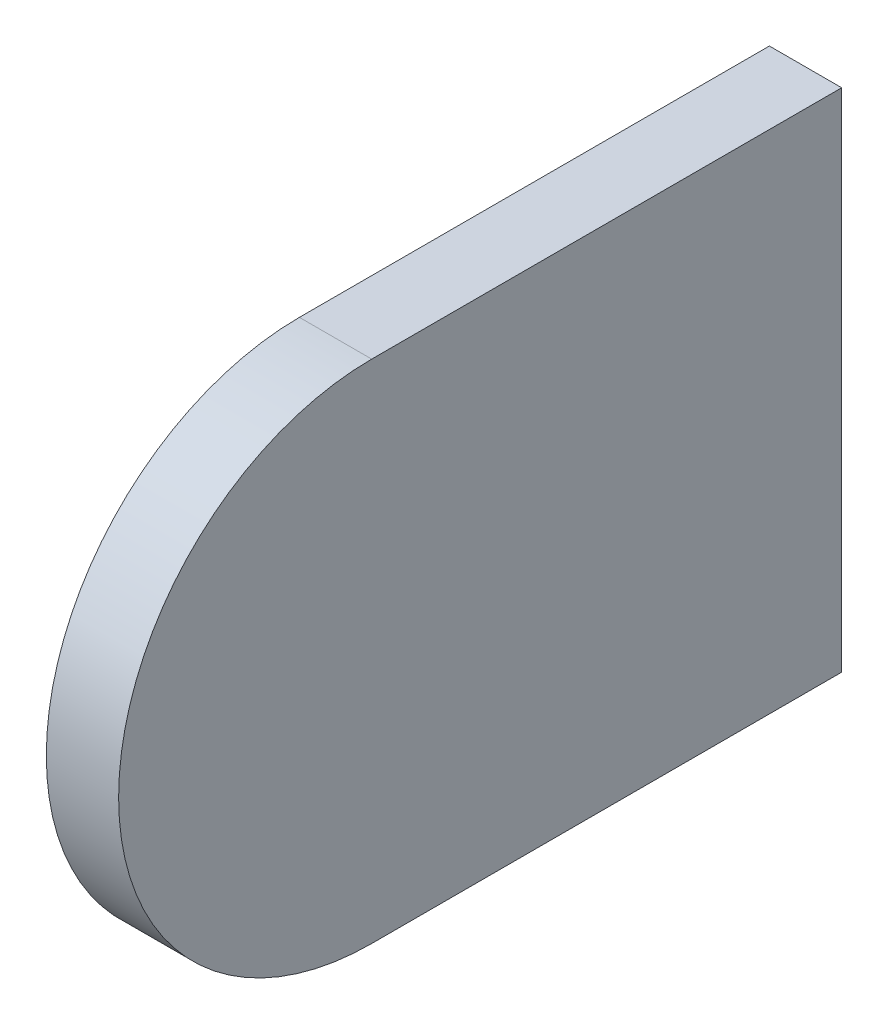
ISO-10303-21;
HEADER;
FILE_DESCRIPTION(('STEP AP214'),'2;1');
FILE_NAME('part.step','',(''),(''),'','','');
FILE_SCHEMA(('AUTOMOTIVE_DESIGN { 1 0 10303 214 1 1 1 1 }'));
ENDSEC;
DATA;
#1=APPLICATION_CONTEXT('core data for automotive mechanical design processes');
#2=APPLICATION_PROTOCOL_DEFINITION('international standard','automotive_design',2000,#1);
#3=PRODUCT_CONTEXT('',#1,'mechanical');
#4=PRODUCT('Part','Part','',(#3));
#5=PRODUCT_RELATED_PRODUCT_CATEGORY('part','',(#4));
#6=PRODUCT_DEFINITION_FORMATION('','',#4);
#7=PRODUCT_DEFINITION_CONTEXT('part definition',#1,'design');
#8=PRODUCT_DEFINITION('design','',#6,#7);
#9=PRODUCT_DEFINITION_SHAPE('','',#8);
#10=(LENGTH_UNIT() NAMED_UNIT(*) SI_UNIT(.MILLI.,.METRE.));
#11=(NAMED_UNIT(*) PLANE_ANGLE_UNIT() SI_UNIT($,.RADIAN.));
#12=(NAMED_UNIT(*) SI_UNIT($,.STERADIAN.) SOLID_ANGLE_UNIT());
#13=UNCERTAINTY_MEASURE_WITH_UNIT(LENGTH_MEASURE(1.E-05),#10,'distance_accuracy_value','');
#14=(GEOMETRIC_REPRESENTATION_CONTEXT(3) GLOBAL_UNCERTAINTY_ASSIGNED_CONTEXT((#13)) GLOBAL_UNIT_ASSIGNED_CONTEXT((#10,
#11,#12)) REPRESENTATION_CONTEXT('',''));
#15=CARTESIAN_POINT('',(0.,0.,0.));
#16=DIRECTION('',(0.,0.,1.));
#17=DIRECTION('',(1.,0.,0.));
#18=AXIS2_PLACEMENT_3D('',#15,#16,#17);
#19=CARTESIAN_POINT('',(0.2,-1.4,0.));
#20=DIRECTION('',(1.,0.,0.));
#21=DIRECTION('',(0.,0.,-1.));
#22=AXIS2_PLACEMENT_3D('',#19,#20,#21);
#23=PLANE('',#22);
#24=DIRECTION('',(0.,1.,0.));
#25=VECTOR('',#24,1.);
#26=CARTESIAN_POINT('',(0.2,0.,0.));
#27=LINE('',#26,#25);
#28=CARTESIAN_POINT('',(0.2,-1.4,0.));
#29=VERTEX_POINT('',#28);
#30=CARTESIAN_POINT('',(0.2,1.4,0.));
#31=VERTEX_POINT('',#30);
#32=EDGE_CURVE('E80',#29,#31,#27,.T.);
#33=ORIENTED_EDGE('',*,*,#32,.T.);
#34=DIRECTION('',(0.,0.,1.));
#35=VECTOR('',#34,1.);
#36=CARTESIAN_POINT('',(0.2,1.4,0.));
#37=LINE('',#36,#35);
#38=CARTESIAN_POINT('',(0.2,1.4,2.6));
#39=VERTEX_POINT('',#38);
#40=EDGE_CURVE('E59',#39,#31,#37,.F.);
#41=ORIENTED_EDGE('',*,*,#40,.F.);
#42=CARTESIAN_POINT('',(0.2,0.,2.6));
#43=DIRECTION('',(1.,0.,0.));
#44=DIRECTION('',(0.,0.,-1.));
#45=AXIS2_PLACEMENT_3D('',#42,#43,#44);
#46=CIRCLE('',#45,1.4);
#47=CARTESIAN_POINT('',(0.2,-1.4,2.6));
#48=VERTEX_POINT('',#47);
#49=EDGE_CURVE('E19',#48,#39,#46,.F.);
#50=ORIENTED_EDGE('',*,*,#49,.F.);
#51=DIRECTION('',(0.,0.,-1.));
#52=VECTOR('',#51,1.);
#53=CARTESIAN_POINT('',(0.2,-1.4,0.));
#54=LINE('',#53,#52);
#55=EDGE_CURVE('E57',#29,#48,#54,.F.);
#56=ORIENTED_EDGE('',*,*,#55,.F.);
#57=EDGE_LOOP('',(#33,#41,#50,#56));
#58=FACE_BOUND('',#57,.T.);
#59=ADVANCED_FACE('F16',(#58),#23,.T.);
#60=CARTESIAN_POINT('',(-0.1,0.,2.6));
#61=DIRECTION('',(1.,0.,0.));
#62=DIRECTION('',(0.,0.,-1.));
#63=AXIS2_PLACEMENT_3D('',#60,#61,#62);
#64=CYLINDRICAL_SURFACE('',#63,1.4);
#65=CARTESIAN_POINT('',(-0.2,0.,2.6));
#66=DIRECTION('',(1.,0.,0.));
#67=DIRECTION('',(0.,0.,-1.));
#68=AXIS2_PLACEMENT_3D('',#65,#66,#67);
#69=CIRCLE('',#68,1.4);
#70=CARTESIAN_POINT('',(-0.2,-1.4,2.6));
#71=VERTEX_POINT('',#70);
#72=CARTESIAN_POINT('',(-0.2,1.4,2.6));
#73=VERTEX_POINT('',#72);
#74=EDGE_CURVE('E67',#71,#73,#69,.F.);
#75=ORIENTED_EDGE('',*,*,#74,.F.);
#76=DIRECTION('',(1.,0.,0.));
#77=VECTOR('',#76,1.);
#78=CARTESIAN_POINT('',(-0.2,-1.4,2.6));
#79=LINE('',#78,#77);
#80=EDGE_CURVE('E64',#48,#71,#79,.F.);
#81=ORIENTED_EDGE('',*,*,#80,.F.);
#82=ORIENTED_EDGE('',*,*,#49,.T.);
#83=DIRECTION('',(1.,0.,0.));
#84=VECTOR('',#83,1.);
#85=CARTESIAN_POINT('',(0.2,1.4,2.6));
#86=LINE('',#85,#84);
#87=EDGE_CURVE('E62',#73,#39,#86,.T.);
#88=ORIENTED_EDGE('',*,*,#87,.F.);
#89=EDGE_LOOP('',(#75,#81,#82,#88));
#90=FACE_BOUND('',#89,.T.);
#91=ADVANCED_FACE('F65',(#90),#64,.T.);
#92=CARTESIAN_POINT('',(0.2,1.4,0.));
#93=DIRECTION('',(0.,1.,0.));
#94=DIRECTION('',(0.,0.,1.));
#95=AXIS2_PLACEMENT_3D('',#92,#93,#94);
#96=PLANE('',#95);
#97=DIRECTION('',(1.,0.,0.));
#98=VECTOR('',#97,1.);
#99=CARTESIAN_POINT('',(0.,1.4,0.));
#100=LINE('',#99,#98);
#101=CARTESIAN_POINT('',(-0.2,1.4,0.));
#102=VERTEX_POINT('',#101);
#103=EDGE_CURVE('E69',#31,#102,#100,.F.);
#104=ORIENTED_EDGE('',*,*,#103,.T.);
#105=DIRECTION('',(0.,0.,1.));
#106=VECTOR('',#105,1.);
#107=CARTESIAN_POINT('',(-0.2,1.4,0.));
#108=LINE('',#107,#106);
#109=EDGE_CURVE('E73',#73,#102,#108,.F.);
#110=ORIENTED_EDGE('',*,*,#109,.F.);
#111=ORIENTED_EDGE('',*,*,#87,.T.);
#112=ORIENTED_EDGE('',*,*,#40,.T.);
#113=EDGE_LOOP('',(#104,#110,#111,#112));
#114=FACE_BOUND('',#113,.T.);
#115=ADVANCED_FACE('F89',(#114),#96,.T.);
#116=CARTESIAN_POINT('',(0.,0.,0.));
#117=DIRECTION('',(0.,0.,1.));
#118=DIRECTION('',(1.,0.,0.));
#119=AXIS2_PLACEMENT_3D('',#116,#117,#118);
#120=PLANE('',#119);
#121=DIRECTION('',(0.,1.,0.));
#122=VECTOR('',#121,1.);
#123=CARTESIAN_POINT('',(-0.2,1.4,0.));
#124=LINE('',#123,#122);
#125=CARTESIAN_POINT('',(-0.2,-1.4,0.));
#126=VERTEX_POINT('',#125);
#127=EDGE_CURVE('E25',#102,#126,#124,.F.);
#128=ORIENTED_EDGE('',*,*,#127,.F.);
#129=ORIENTED_EDGE('',*,*,#103,.F.);
#130=ORIENTED_EDGE('',*,*,#32,.F.);
#131=DIRECTION('',(1.,0.,0.));
#132=VECTOR('',#131,1.);
#133=CARTESIAN_POINT('',(-0.2,-1.4,0.));
#134=LINE('',#133,#132);
#135=EDGE_CURVE('E34',#126,#29,#134,.T.);
#136=ORIENTED_EDGE('',*,*,#135,.F.);
#137=EDGE_LOOP('',(#128,#129,#130,#136));
#138=FACE_BOUND('',#137,.T.);
#139=ADVANCED_FACE('F106',(#138),#120,.F.);
#140=CARTESIAN_POINT('',(-0.2,-1.4,0.));
#141=DIRECTION('',(0.,-1.,0.));
#142=DIRECTION('',(0.,0.,-1.));
#143=AXIS2_PLACEMENT_3D('',#140,#141,#142);
#144=PLANE('',#143);
#145=ORIENTED_EDGE('',*,*,#135,.T.);
#146=ORIENTED_EDGE('',*,*,#55,.T.);
#147=ORIENTED_EDGE('',*,*,#80,.T.);
#148=DIRECTION('',(0.,0.,1.));
#149=VECTOR('',#148,1.);
#150=CARTESIAN_POINT('',(-0.2,-1.4,0.));
#151=LINE('',#150,#149);
#152=EDGE_CURVE('E11',#126,#71,#151,.T.);
#153=ORIENTED_EDGE('',*,*,#152,.F.);
#154=EDGE_LOOP('',(#145,#146,#147,#153));
#155=FACE_BOUND('',#154,.T.);
#156=ADVANCED_FACE('F71',(#155),#144,.T.);
#157=CARTESIAN_POINT('',(-0.2,1.4,0.));
#158=DIRECTION('',(-1.,0.,0.));
#159=DIRECTION('',(0.,0.,1.));
#160=AXIS2_PLACEMENT_3D('',#157,#158,#159);
#161=PLANE('',#160);
#162=ORIENTED_EDGE('',*,*,#127,.T.);
#163=ORIENTED_EDGE('',*,*,#152,.T.);
#164=ORIENTED_EDGE('',*,*,#74,.T.);
#165=ORIENTED_EDGE('',*,*,#109,.T.);
#166=EDGE_LOOP('',(#162,#163,#164,#165));
#167=FACE_BOUND('',#166,.T.);
#168=ADVANCED_FACE('F94',(#167),#161,.T.);
#169=CLOSED_SHELL('',(#59,#91,#115,#139,#156,#168));
#170=MANIFOLD_SOLID_BREP('B1',#169);
#171=ADVANCED_BREP_SHAPE_REPRESENTATION('',(#18,#170),#14);
#172=SHAPE_DEFINITION_REPRESENTATION(#9,#171);
ENDSEC;
END-ISO-10303-21;
